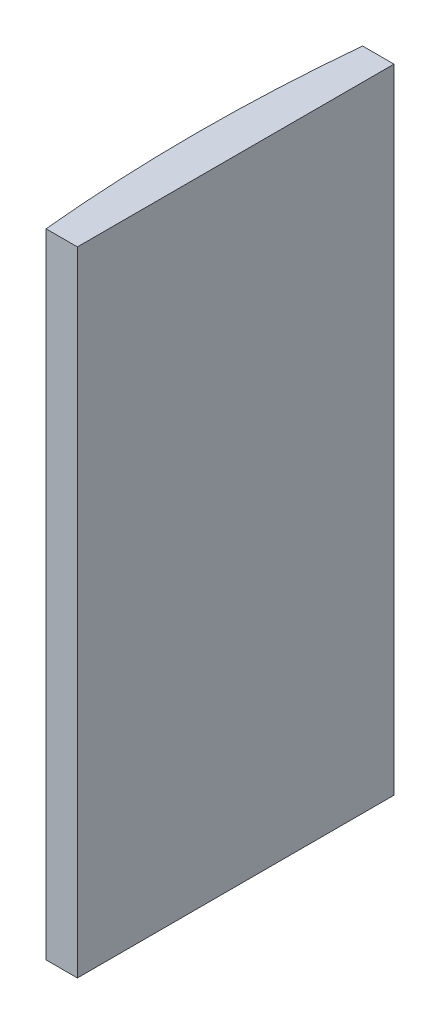
ISO-10303-21;
HEADER;
FILE_DESCRIPTION(('STEP AP214'),'2;1');
FILE_NAME('part.step','',(''),(''),'','','');
FILE_SCHEMA(('AUTOMOTIVE_DESIGN { 1 0 10303 214 1 1 1 1 }'));
ENDSEC;
DATA;
#1=APPLICATION_CONTEXT('core data for automotive mechanical design processes');
#2=APPLICATION_PROTOCOL_DEFINITION('international standard','automotive_design',2000,#1);
#3=PRODUCT_CONTEXT('',#1,'mechanical');
#4=PRODUCT('Part','Part','',(#3));
#5=PRODUCT_RELATED_PRODUCT_CATEGORY('part','',(#4));
#6=PRODUCT_DEFINITION_FORMATION('','',#4);
#7=PRODUCT_DEFINITION_CONTEXT('part definition',#1,'design');
#8=PRODUCT_DEFINITION('design','',#6,#7);
#9=PRODUCT_DEFINITION_SHAPE('','',#8);
#10=(LENGTH_UNIT() NAMED_UNIT(*) SI_UNIT(.MILLI.,.METRE.));
#11=(NAMED_UNIT(*) PLANE_ANGLE_UNIT() SI_UNIT($,.RADIAN.));
#12=(NAMED_UNIT(*) SI_UNIT($,.STERADIAN.) SOLID_ANGLE_UNIT());
#13=UNCERTAINTY_MEASURE_WITH_UNIT(LENGTH_MEASURE(1.E-05),#10,'distance_accuracy_value','');
#14=(GEOMETRIC_REPRESENTATION_CONTEXT(3) GLOBAL_UNCERTAINTY_ASSIGNED_CONTEXT((#13)) GLOBAL_UNIT_ASSIGNED_CONTEXT((#10,
#11,#12)) REPRESENTATION_CONTEXT('',''));
#15=CARTESIAN_POINT('',(0.,0.,0.));
#16=DIRECTION('',(0.,0.,1.));
#17=DIRECTION('',(1.,0.,0.));
#18=AXIS2_PLACEMENT_3D('',#15,#16,#17);
#19=CARTESIAN_POINT('',(4.35520433485127,60.,0.));
#20=DIRECTION('',(0.,-1.,0.));
#21=DIRECTION('',(0.,0.,-1.));
#22=AXIS2_PLACEMENT_3D('',#19,#20,#21);
#23=CYLINDRICAL_SURFACE('',#22,155.1);
#24=CARTESIAN_POINT('',(4.35520433485127,0.,0.));
#25=DIRECTION('',(0.,1.,0.));
#26=DIRECTION('',(0.,0.,1.));
#27=AXIS2_PLACEMENT_3D('',#24,#25,#26);
#28=CIRCLE('',#27,155.1);
#29=CARTESIAN_POINT('',(-150.017753141515,0.,-15.));
#30=VERTEX_POINT('',#29);
#31=CARTESIAN_POINT('',(-150.017753141515,0.,15.));
#32=VERTEX_POINT('',#31);
#33=EDGE_CURVE('E100',#30,#32,#28,.T.);
#34=ORIENTED_EDGE('',*,*,#33,.T.);
#35=DIRECTION('',(0.,-1.,0.));
#36=VECTOR('',#35,1.);
#37=CARTESIAN_POINT('',(-150.017753141515,60.,15.));
#38=LINE('',#37,#36);
#39=CARTESIAN_POINT('',(-150.017753141515,60.,15.));
#40=VERTEX_POINT('',#39);
#41=EDGE_CURVE('E11',#40,#32,#38,.T.);
#42=ORIENTED_EDGE('',*,*,#41,.F.);
#43=CARTESIAN_POINT('',(4.35520433485127,60.,0.));
#44=DIRECTION('',(0.,1.,0.));
#45=DIRECTION('',(0.,0.,1.));
#46=AXIS2_PLACEMENT_3D('',#43,#44,#45);
#47=CIRCLE('',#46,155.1);
#48=CARTESIAN_POINT('',(-150.017753141515,60.,-15.));
#49=VERTEX_POINT('',#48);
#50=EDGE_CURVE('E88',#49,#40,#47,.T.);
#51=ORIENTED_EDGE('',*,*,#50,.F.);
#52=DIRECTION('',(0.,-1.,0.));
#53=VECTOR('',#52,1.);
#54=CARTESIAN_POINT('',(-150.017753141515,60.,-15.));
#55=LINE('',#54,#53);
#56=EDGE_CURVE('E96',#49,#30,#55,.T.);
#57=ORIENTED_EDGE('',*,*,#56,.T.);
#58=EDGE_LOOP('',(#34,#42,#51,#57));
#59=FACE_BOUND('',#58,.T.);
#60=ADVANCED_FACE('F37',(#59),#23,.T.);
#61=CARTESIAN_POINT('',(-150.017753141515,60.,15.));
#62=DIRECTION('',(0.,0.,-1.));
#63=DIRECTION('',(-1.,0.,0.));
#64=AXIS2_PLACEMENT_3D('',#61,#62,#63);
#65=PLANE('',#64);
#66=DIRECTION('',(1.,0.,0.));
#67=VECTOR('',#66,1.);
#68=CARTESIAN_POINT('',(-150.017753141515,0.,15.));
#69=LINE('',#68,#67);
#70=CARTESIAN_POINT('',(-147.044795665149,0.,15.));
#71=VERTEX_POINT('',#70);
#72=EDGE_CURVE('E92',#32,#71,#69,.T.);
#73=ORIENTED_EDGE('',*,*,#72,.T.);
#74=DIRECTION('',(0.,-1.,0.));
#75=VECTOR('',#74,1.);
#76=CARTESIAN_POINT('',(-147.044795665149,60.,15.));
#77=LINE('',#76,#75);
#78=CARTESIAN_POINT('',(-147.044795665149,60.,15.));
#79=VERTEX_POINT('',#78);
#80=EDGE_CURVE('E45',#79,#71,#77,.T.);
#81=ORIENTED_EDGE('',*,*,#80,.F.);
#82=DIRECTION('',(1.,0.,0.));
#83=VECTOR('',#82,1.);
#84=CARTESIAN_POINT('',(-150.017753141515,60.,15.));
#85=LINE('',#84,#83);
#86=EDGE_CURVE('E83',#40,#79,#85,.T.);
#87=ORIENTED_EDGE('',*,*,#86,.F.);
#88=ORIENTED_EDGE('',*,*,#41,.T.);
#89=EDGE_LOOP('',(#73,#81,#87,#88));
#90=FACE_BOUND('',#89,.T.);
#91=ADVANCED_FACE('F91',(#90),#65,.F.);
#92=CARTESIAN_POINT('',(-147.044795665149,60.,-15.));
#93=DIRECTION('',(-1.,0.,0.));
#94=DIRECTION('',(0.,0.,1.));
#95=AXIS2_PLACEMENT_3D('',#92,#93,#94);
#96=PLANE('',#95);
#97=DIRECTION('',(0.,0.,-1.));
#98=VECTOR('',#97,1.);
#99=CARTESIAN_POINT('',(-147.044795665149,0.,-15.));
#100=LINE('',#99,#98);
#101=CARTESIAN_POINT('',(-147.044795665149,0.,-15.));
#102=VERTEX_POINT('',#101);
#103=EDGE_CURVE('E70',#71,#102,#100,.T.);
#104=ORIENTED_EDGE('',*,*,#103,.T.);
#105=DIRECTION('',(0.,-1.,0.));
#106=VECTOR('',#105,1.);
#107=CARTESIAN_POINT('',(-147.044795665149,60.,-15.));
#108=LINE('',#107,#106);
#109=CARTESIAN_POINT('',(-147.044795665149,60.,-15.));
#110=VERTEX_POINT('',#109);
#111=EDGE_CURVE('E93',#110,#102,#108,.T.);
#112=ORIENTED_EDGE('',*,*,#111,.F.);
#113=DIRECTION('',(0.,0.,-1.));
#114=VECTOR('',#113,1.);
#115=CARTESIAN_POINT('',(-147.044795665149,60.,-15.));
#116=LINE('',#115,#114);
#117=EDGE_CURVE('E86',#79,#110,#116,.T.);
#118=ORIENTED_EDGE('',*,*,#117,.F.);
#119=ORIENTED_EDGE('',*,*,#80,.T.);
#120=EDGE_LOOP('',(#104,#112,#118,#119));
#121=FACE_BOUND('',#120,.T.);
#122=ADVANCED_FACE('F94',(#121),#96,.F.);
#123=CARTESIAN_POINT('',(-150.017753141515,60.,-15.));
#124=DIRECTION('',(0.,0.,1.));
#125=DIRECTION('',(1.,0.,0.));
#126=AXIS2_PLACEMENT_3D('',#123,#124,#125);
#127=PLANE('',#126);
#128=DIRECTION('',(-1.,0.,0.));
#129=VECTOR('',#128,1.);
#130=CARTESIAN_POINT('',(-150.017753141515,0.,-15.));
#131=LINE('',#130,#129);
#132=EDGE_CURVE('E76',#102,#30,#131,.T.);
#133=ORIENTED_EDGE('',*,*,#132,.T.);
#134=ORIENTED_EDGE('',*,*,#56,.F.);
#135=DIRECTION('',(-1.,0.,0.));
#136=VECTOR('',#135,1.);
#137=CARTESIAN_POINT('',(-150.017753141515,60.,-15.));
#138=LINE('',#137,#136);
#139=EDGE_CURVE('E53',#110,#49,#138,.T.);
#140=ORIENTED_EDGE('',*,*,#139,.F.);
#141=ORIENTED_EDGE('',*,*,#111,.T.);
#142=EDGE_LOOP('',(#133,#134,#140,#141));
#143=FACE_BOUND('',#142,.T.);
#144=ADVANCED_FACE('F107',(#143),#127,.F.);
#145=CARTESIAN_POINT('',(4.35520433485127,60.,0.));
#146=DIRECTION('',(0.,1.,0.));
#147=DIRECTION('',(0.,0.,1.));
#148=AXIS2_PLACEMENT_3D('',#145,#146,#147);
#149=PLANE('',#148);
#150=ORIENTED_EDGE('',*,*,#50,.T.);
#151=ORIENTED_EDGE('',*,*,#86,.T.);
#152=ORIENTED_EDGE('',*,*,#117,.T.);
#153=ORIENTED_EDGE('',*,*,#139,.T.);
#154=EDGE_LOOP('',(#150,#151,#152,#153));
#155=FACE_BOUND('',#154,.T.);
#156=ADVANCED_FACE('F84',(#155),#149,.T.);
#157=CARTESIAN_POINT('',(4.35520433485127,0.,0.));
#158=DIRECTION('',(0.,1.,0.));
#159=DIRECTION('',(0.,0.,1.));
#160=AXIS2_PLACEMENT_3D('',#157,#158,#159);
#161=PLANE('',#160);
#162=ORIENTED_EDGE('',*,*,#33,.F.);
#163=ORIENTED_EDGE('',*,*,#132,.F.);
#164=ORIENTED_EDGE('',*,*,#103,.F.);
#165=ORIENTED_EDGE('',*,*,#72,.F.);
#166=EDGE_LOOP('',(#162,#163,#164,#165));
#167=FACE_BOUND('',#166,.T.);
#168=ADVANCED_FACE('F110',(#167),#161,.F.);
#169=CLOSED_SHELL('',(#60,#91,#122,#144,#156,#168));
#170=MANIFOLD_SOLID_BREP('B2',#169);
#171=ADVANCED_BREP_SHAPE_REPRESENTATION('',(#18,#170),#14);
#172=SHAPE_DEFINITION_REPRESENTATION(#9,#171);
ENDSEC;
END-ISO-10303-21;
